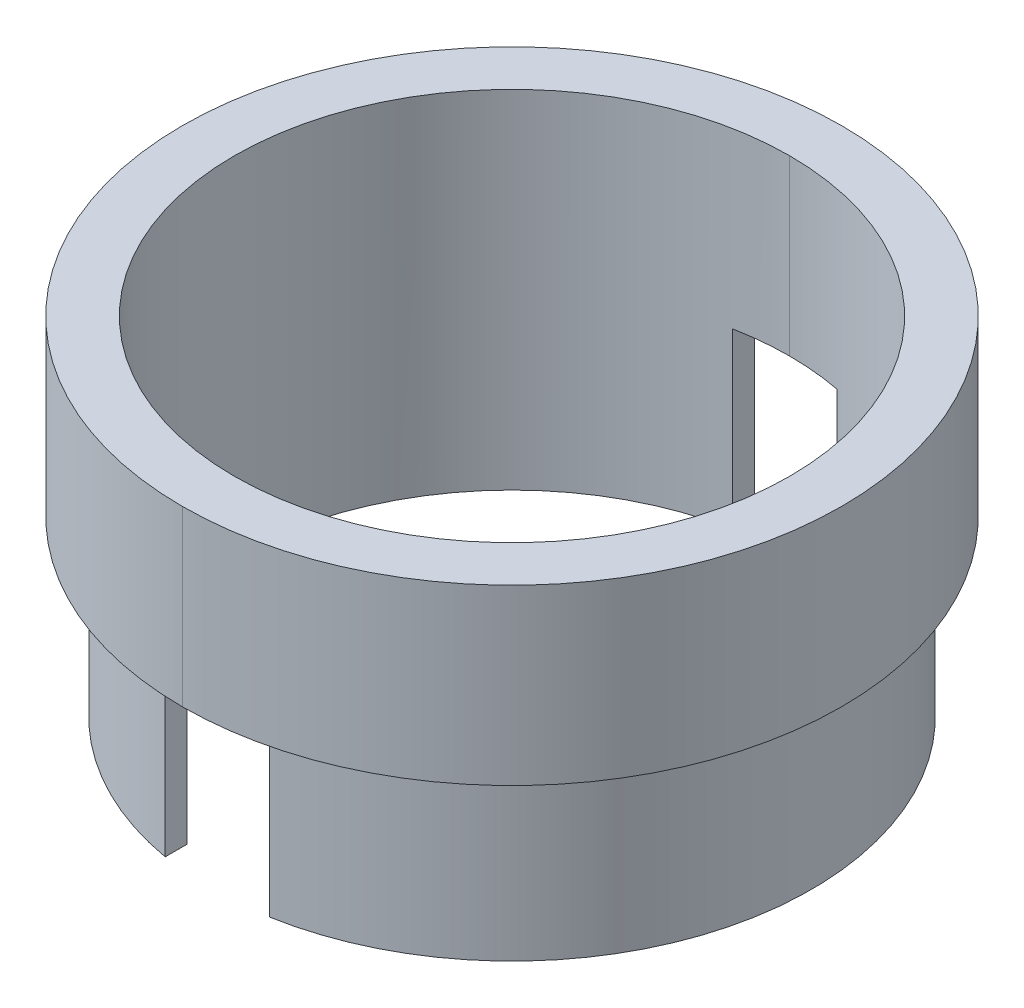
ISO-10303-21;
HEADER;
FILE_DESCRIPTION(('STEP AP214'),'2;1');
FILE_NAME('part.step','',(''),(''),'','','');
FILE_SCHEMA(('AUTOMOTIVE_DESIGN { 1 0 10303 214 1 1 1 1 }'));
ENDSEC;
DATA;
#1=APPLICATION_CONTEXT('core data for automotive mechanical design processes');
#2=APPLICATION_PROTOCOL_DEFINITION('international standard','automotive_design',2000,#1);
#3=PRODUCT_CONTEXT('',#1,'mechanical');
#4=PRODUCT('Part','Part','',(#3));
#5=PRODUCT_RELATED_PRODUCT_CATEGORY('part','',(#4));
#6=PRODUCT_DEFINITION_FORMATION('','',#4);
#7=PRODUCT_DEFINITION_CONTEXT('part definition',#1,'design');
#8=PRODUCT_DEFINITION('design','',#6,#7);
#9=PRODUCT_DEFINITION_SHAPE('','',#8);
#10=(LENGTH_UNIT() NAMED_UNIT(*) SI_UNIT(.MILLI.,.METRE.));
#11=(NAMED_UNIT(*) PLANE_ANGLE_UNIT() SI_UNIT($,.RADIAN.));
#12=(NAMED_UNIT(*) SI_UNIT($,.STERADIAN.) SOLID_ANGLE_UNIT());
#13=UNCERTAINTY_MEASURE_WITH_UNIT(LENGTH_MEASURE(1.E-05),#10,'distance_accuracy_value','');
#14=(GEOMETRIC_REPRESENTATION_CONTEXT(3) GLOBAL_UNCERTAINTY_ASSIGNED_CONTEXT((#13)) GLOBAL_UNIT_ASSIGNED_CONTEXT((#10,
#11,#12)) REPRESENTATION_CONTEXT('',''));
#15=CARTESIAN_POINT('',(0.,0.,0.));
#16=DIRECTION('',(0.,0.,1.));
#17=DIRECTION('',(1.,0.,0.));
#18=AXIS2_PLACEMENT_3D('',#15,#16,#17);
#19=CARTESIAN_POINT('',(0.,-5.,0.));
#20=DIRECTION('',(0.,-1.,0.));
#21=DIRECTION('',(0.,0.,-1.));
#22=AXIS2_PLACEMENT_3D('',#19,#20,#21);
#23=PLANE('',#22);
#24=DIRECTION('',(0.,0.,1.));
#25=VECTOR('',#24,1.);
#26=CARTESIAN_POINT('',(1.5,-5.,0.));
#27=LINE('',#26,#25);
#28=CARTESIAN_POINT('',(1.5,-5.,-8.49356373967959));
#29=VERTEX_POINT('',#28);
#30=CARTESIAN_POINT('',(1.5,-5.,-7.85811682275086));
#31=VERTEX_POINT('',#30);
#32=EDGE_CURVE('E98',#29,#31,#27,.T.);
#33=ORIENTED_EDGE('',*,*,#32,.F.);
#34=CARTESIAN_POINT('',(0.,-5.,0.));
#35=DIRECTION('',(0.,-1.,0.));
#36=DIRECTION('',(0.,0.,-1.));
#37=AXIS2_PLACEMENT_3D('',#34,#35,#36);
#38=CIRCLE('',#37,8.625);
#39=CARTESIAN_POINT('',(1.5,-5.,8.49356373967959));
#40=VERTEX_POINT('',#39);
#41=EDGE_CURVE('E26',#29,#40,#38,.T.);
#42=ORIENTED_EDGE('',*,*,#41,.T.);
#43=DIRECTION('',(0.,0.,1.));
#44=VECTOR('',#43,1.);
#45=CARTESIAN_POINT('',(1.5,-5.,0.));
#46=LINE('',#45,#44);
#47=CARTESIAN_POINT('',(1.5,-5.,7.85811682275086));
#48=VERTEX_POINT('',#47);
#49=EDGE_CURVE('E10',#48,#40,#46,.T.);
#50=ORIENTED_EDGE('',*,*,#49,.F.);
#51=CARTESIAN_POINT('',(0.,-5.,0.));
#52=DIRECTION('',(0.,1.,0.));
#53=DIRECTION('',(0.,0.,-1.));
#54=AXIS2_PLACEMENT_3D('',#51,#52,#53);
#55=CIRCLE('',#54,8.);
#56=EDGE_CURVE('E197',#48,#31,#55,.T.);
#57=ORIENTED_EDGE('',*,*,#56,.T.);
#58=EDGE_LOOP('',(#33,#42,#50,#57));
#59=FACE_BOUND('',#58,.T.);
#60=ADVANCED_FACE('F16',(#59),#23,.T.);
#61=CARTESIAN_POINT('',(1.5,-5.,0.));
#62=DIRECTION('',(-1.,0.,0.));
#63=DIRECTION('',(0.,0.,1.));
#64=AXIS2_PLACEMENT_3D('',#61,#62,#63);
#65=PLANE('',#64);
#66=DIRECTION('',(0.,0.,1.));
#67=VECTOR('',#66,1.);
#68=CARTESIAN_POINT('',(1.5,0.,0.));
#69=LINE('',#68,#67);
#70=CARTESIAN_POINT('',(1.5,0.,7.85811682275086));
#71=VERTEX_POINT('',#70);
#72=CARTESIAN_POINT('',(1.5,0.,8.49356373967959));
#73=VERTEX_POINT('',#72);
#74=EDGE_CURVE('E246',#71,#73,#69,.T.);
#75=ORIENTED_EDGE('',*,*,#74,.F.);
#76=DIRECTION('',(0.,1.,0.));
#77=VECTOR('',#76,1.);
#78=CARTESIAN_POINT('',(1.5,-5.,7.85811682275086));
#79=LINE('',#78,#77);
#80=EDGE_CURVE('E194',#48,#71,#79,.T.);
#81=ORIENTED_EDGE('',*,*,#80,.F.);
#82=ORIENTED_EDGE('',*,*,#49,.T.);
#83=DIRECTION('',(0.,1.,0.));
#84=VECTOR('',#83,1.);
#85=CARTESIAN_POINT('',(1.5,-5.,8.49356373967959));
#86=LINE('',#85,#84);
#87=EDGE_CURVE('E183',#40,#73,#86,.T.);
#88=ORIENTED_EDGE('',*,*,#87,.T.);
#89=EDGE_LOOP('',(#75,#81,#82,#88));
#90=FACE_BOUND('',#89,.T.);
#91=ADVANCED_FACE('F297',(#90),#65,.T.);
#92=CARTESIAN_POINT('',(0.,-5.,0.));
#93=DIRECTION('',(0.,1.,0.));
#94=DIRECTION('',(0.,0.,1.));
#95=AXIS2_PLACEMENT_3D('',#92,#93,#94);
#96=CYLINDRICAL_SURFACE('',#95,8.625);
#97=CARTESIAN_POINT('',(0.,0.,0.));
#98=DIRECTION('',(0.,-1.,0.));
#99=DIRECTION('',(0.,0.,-1.));
#100=AXIS2_PLACEMENT_3D('',#97,#98,#99);
#101=CIRCLE('',#100,8.625);
#102=CARTESIAN_POINT('',(1.5,0.,-8.49356373967959));
#103=VERTEX_POINT('',#102);
#104=EDGE_CURVE('E214',#103,#73,#101,.T.);
#105=ORIENTED_EDGE('',*,*,#104,.T.);
#106=ORIENTED_EDGE('',*,*,#87,.F.);
#107=ORIENTED_EDGE('',*,*,#41,.F.);
#108=DIRECTION('',(0.,1.,0.));
#109=VECTOR('',#108,1.);
#110=CARTESIAN_POINT('',(1.5,-5.,-8.49356373967959));
#111=LINE('',#110,#109);
#112=EDGE_CURVE('E208',#29,#103,#111,.T.);
#113=ORIENTED_EDGE('',*,*,#112,.T.);
#114=EDGE_LOOP('',(#105,#106,#107,#113));
#115=FACE_BOUND('',#114,.T.);
#116=ADVANCED_FACE('F295',(#115),#96,.T.);
#117=CARTESIAN_POINT('',(1.5,-5.,0.));
#118=DIRECTION('',(-1.,0.,0.));
#119=DIRECTION('',(0.,0.,1.));
#120=AXIS2_PLACEMENT_3D('',#117,#118,#119);
#121=PLANE('',#120);
#122=DIRECTION('',(0.,0.,1.));
#123=VECTOR('',#122,1.);
#124=CARTESIAN_POINT('',(1.5,0.,0.));
#125=LINE('',#124,#123);
#126=CARTESIAN_POINT('',(1.5,0.,-7.85811682275086));
#127=VERTEX_POINT('',#126);
#128=EDGE_CURVE('E209',#103,#127,#125,.T.);
#129=ORIENTED_EDGE('',*,*,#128,.F.);
#130=ORIENTED_EDGE('',*,*,#112,.F.);
#131=ORIENTED_EDGE('',*,*,#32,.T.);
#132=DIRECTION('',(0.,1.,0.));
#133=VECTOR('',#132,1.);
#134=CARTESIAN_POINT('',(1.5,-5.,-7.85811682275086));
#135=LINE('',#134,#133);
#136=EDGE_CURVE('E239',#31,#127,#135,.T.);
#137=ORIENTED_EDGE('',*,*,#136,.T.);
#138=EDGE_LOOP('',(#129,#130,#131,#137));
#139=FACE_BOUND('',#138,.T.);
#140=ADVANCED_FACE('F291',(#139),#121,.T.);
#141=CARTESIAN_POINT('',(0.,-5.,0.));
#142=DIRECTION('',(0.,-1.,0.));
#143=DIRECTION('',(0.,0.,-1.));
#144=AXIS2_PLACEMENT_3D('',#141,#142,#143);
#145=PLANE('',#144);
#146=DIRECTION('',(0.,0.,-1.));
#147=VECTOR('',#146,1.);
#148=CARTESIAN_POINT('',(-1.5,-5.,0.));
#149=LINE('',#148,#147);
#150=CARTESIAN_POINT('',(-1.5,-5.,8.49356373967959));
#151=VERTEX_POINT('',#150);
#152=CARTESIAN_POINT('',(-1.5,-5.,7.85811682275086));
#153=VERTEX_POINT('',#152);
#154=EDGE_CURVE('E182',#151,#153,#149,.T.);
#155=ORIENTED_EDGE('',*,*,#154,.F.);
#156=CARTESIAN_POINT('',(0.,-5.,0.));
#157=DIRECTION('',(0.,-1.,0.));
#158=DIRECTION('',(0.,0.,-1.));
#159=AXIS2_PLACEMENT_3D('',#156,#157,#158);
#160=CIRCLE('',#159,8.625);
#161=CARTESIAN_POINT('',(-1.5,-5.,-8.49356373967959));
#162=VERTEX_POINT('',#161);
#163=EDGE_CURVE('E181',#151,#162,#160,.T.);
#164=ORIENTED_EDGE('',*,*,#163,.T.);
#165=DIRECTION('',(0.,0.,-1.));
#166=VECTOR('',#165,1.);
#167=CARTESIAN_POINT('',(-1.5,-5.,0.));
#168=LINE('',#167,#166);
#169=CARTESIAN_POINT('',(-1.5,-5.,-7.85811682275086));
#170=VERTEX_POINT('',#169);
#171=EDGE_CURVE('E204',#170,#162,#168,.T.);
#172=ORIENTED_EDGE('',*,*,#171,.F.);
#173=CARTESIAN_POINT('',(0.,-5.,0.));
#174=DIRECTION('',(0.,1.,0.));
#175=DIRECTION('',(0.,0.,-1.));
#176=AXIS2_PLACEMENT_3D('',#173,#174,#175);
#177=CIRCLE('',#176,8.);
#178=EDGE_CURVE('E172',#170,#153,#177,.T.);
#179=ORIENTED_EDGE('',*,*,#178,.T.);
#180=EDGE_LOOP('',(#155,#164,#172,#179));
#181=FACE_BOUND('',#180,.T.);
#182=ADVANCED_FACE('F283',(#181),#145,.T.);
#183=CARTESIAN_POINT('',(-1.5,-5.,0.));
#184=DIRECTION('',(1.,0.,0.));
#185=DIRECTION('',(0.,1.,0.));
#186=AXIS2_PLACEMENT_3D('',#183,#184,#185);
#187=PLANE('',#186);
#188=DIRECTION('',(0.,0.,-1.));
#189=VECTOR('',#188,1.);
#190=CARTESIAN_POINT('',(-1.5,0.,0.));
#191=LINE('',#190,#189);
#192=CARTESIAN_POINT('',(-1.5,0.,-7.85811682275086));
#193=VERTEX_POINT('',#192);
#194=CARTESIAN_POINT('',(-1.5,0.,-8.49356373967959));
#195=VERTEX_POINT('',#194);
#196=EDGE_CURVE('E203',#193,#195,#191,.T.);
#197=ORIENTED_EDGE('',*,*,#196,.F.);
#198=DIRECTION('',(0.,1.,0.));
#199=VECTOR('',#198,1.);
#200=CARTESIAN_POINT('',(-1.5,-5.,-7.85811682275086));
#201=LINE('',#200,#199);
#202=EDGE_CURVE('E176',#170,#193,#201,.T.);
#203=ORIENTED_EDGE('',*,*,#202,.F.);
#204=ORIENTED_EDGE('',*,*,#171,.T.);
#205=DIRECTION('',(0.,1.,0.));
#206=VECTOR('',#205,1.);
#207=CARTESIAN_POINT('',(-1.5,-5.,-8.49356373967959));
#208=LINE('',#207,#206);
#209=EDGE_CURVE('E178',#162,#195,#208,.T.);
#210=ORIENTED_EDGE('',*,*,#209,.T.);
#211=EDGE_LOOP('',(#197,#203,#204,#210));
#212=FACE_BOUND('',#211,.T.);
#213=ADVANCED_FACE('F287',(#212),#187,.T.);
#214=CARTESIAN_POINT('',(0.,-5.,0.));
#215=DIRECTION('',(0.,1.,0.));
#216=DIRECTION('',(0.,0.,1.));
#217=AXIS2_PLACEMENT_3D('',#214,#215,#216);
#218=CYLINDRICAL_SURFACE('',#217,8.625);
#219=CARTESIAN_POINT('',(0.,0.,0.));
#220=DIRECTION('',(0.,-1.,0.));
#221=DIRECTION('',(0.,0.,-1.));
#222=AXIS2_PLACEMENT_3D('',#219,#220,#221);
#223=CIRCLE('',#222,8.625);
#224=CARTESIAN_POINT('',(-1.5,0.,8.49356373967959));
#225=VERTEX_POINT('',#224);
#226=EDGE_CURVE('E198',#225,#195,#223,.T.);
#227=ORIENTED_EDGE('',*,*,#226,.T.);
#228=ORIENTED_EDGE('',*,*,#209,.F.);
#229=ORIENTED_EDGE('',*,*,#163,.F.);
#230=DIRECTION('',(0.,1.,0.));
#231=VECTOR('',#230,1.);
#232=CARTESIAN_POINT('',(-1.5,-5.,8.49356373967959));
#233=LINE('',#232,#231);
#234=EDGE_CURVE('E193',#151,#225,#233,.T.);
#235=ORIENTED_EDGE('',*,*,#234,.T.);
#236=EDGE_LOOP('',(#227,#228,#229,#235));
#237=FACE_BOUND('',#236,.T.);
#238=ADVANCED_FACE('F319',(#237),#218,.T.);
#239=CARTESIAN_POINT('',(-1.5,-5.,0.));
#240=DIRECTION('',(1.,0.,0.));
#241=DIRECTION('',(0.,1.,0.));
#242=AXIS2_PLACEMENT_3D('',#239,#240,#241);
#243=PLANE('',#242);
#244=DIRECTION('',(0.,0.,-1.));
#245=VECTOR('',#244,1.);
#246=CARTESIAN_POINT('',(-1.5,0.,0.));
#247=LINE('',#246,#245);
#248=CARTESIAN_POINT('',(-1.5,0.,7.85811682275086));
#249=VERTEX_POINT('',#248);
#250=EDGE_CURVE('E202',#225,#249,#247,.T.);
#251=ORIENTED_EDGE('',*,*,#250,.F.);
#252=ORIENTED_EDGE('',*,*,#234,.F.);
#253=ORIENTED_EDGE('',*,*,#154,.T.);
#254=DIRECTION('',(0.,1.,0.));
#255=VECTOR('',#254,1.);
#256=CARTESIAN_POINT('',(-1.5,-5.,7.85811682275086));
#257=LINE('',#256,#255);
#258=EDGE_CURVE('E177',#153,#249,#257,.T.);
#259=ORIENTED_EDGE('',*,*,#258,.T.);
#260=EDGE_LOOP('',(#251,#252,#253,#259));
#261=FACE_BOUND('',#260,.T.);
#262=ADVANCED_FACE('F279',(#261),#243,.T.);
#263=CARTESIAN_POINT('',(0.,5.,0.));
#264=DIRECTION('',(0.,-1.,0.));
#265=DIRECTION('',(0.,0.,-1.));
#266=AXIS2_PLACEMENT_3D('',#263,#264,#265);
#267=CYLINDRICAL_SURFACE('',#266,8.);
#268=DIRECTION('',(0.,-1.,0.));
#269=VECTOR('',#268,1.);
#270=CARTESIAN_POINT('',(0.,5.,8.));
#271=LINE('',#270,#269);
#272=CARTESIAN_POINT('',(0.,5.,8.));
#273=VERTEX_POINT('',#272);
#274=CARTESIAN_POINT('',(0.,0.,8.));
#275=VERTEX_POINT('',#274);
#276=EDGE_CURVE('E146',#273,#275,#271,.T.);
#277=ORIENTED_EDGE('',*,*,#276,.F.);
#278=CARTESIAN_POINT('',(0.,5.,0.));
#279=DIRECTION('',(0.,1.,0.));
#280=DIRECTION('',(0.,0.,1.));
#281=AXIS2_PLACEMENT_3D('',#278,#279,#280);
#282=CIRCLE('',#281,8.);
#283=CARTESIAN_POINT('',(0.,5.,-8.));
#284=VERTEX_POINT('',#283);
#285=EDGE_CURVE('E138',#273,#284,#282,.T.);
#286=ORIENTED_EDGE('',*,*,#285,.T.);
#287=DIRECTION('',(0.,-1.,0.));
#288=VECTOR('',#287,1.);
#289=CARTESIAN_POINT('',(0.,5.,-8.));
#290=LINE('',#289,#288);
#291=CARTESIAN_POINT('',(0.,0.,-8.));
#292=VERTEX_POINT('',#291);
#293=EDGE_CURVE('E142',#284,#292,#290,.T.);
#294=ORIENTED_EDGE('',*,*,#293,.T.);
#295=CARTESIAN_POINT('',(0.,0.,0.));
#296=DIRECTION('',(0.,1.,0.));
#297=DIRECTION('',(0.,0.,1.));
#298=AXIS2_PLACEMENT_3D('',#295,#296,#297);
#299=CIRCLE('',#298,8.);
#300=EDGE_CURVE('E213',#127,#292,#299,.T.);
#301=ORIENTED_EDGE('',*,*,#300,.F.);
#302=ORIENTED_EDGE('',*,*,#136,.F.);
#303=ORIENTED_EDGE('',*,*,#56,.F.);
#304=ORIENTED_EDGE('',*,*,#80,.T.);
#305=CARTESIAN_POINT('',(0.,0.,0.));
#306=DIRECTION('',(0.,1.,0.));
#307=DIRECTION('',(0.,0.,1.));
#308=AXIS2_PLACEMENT_3D('',#305,#306,#307);
#309=CIRCLE('',#308,8.);
#310=EDGE_CURVE('E242',#275,#71,#309,.T.);
#311=ORIENTED_EDGE('',*,*,#310,.F.);
#312=EDGE_LOOP('',(#277,#286,#294,#301,#302,#303,#304,#311));
#313=FACE_BOUND('',#312,.T.);
#314=ADVANCED_FACE('F140',(#313),#267,.F.);
#315=CARTESIAN_POINT('',(0.,5.,0.));
#316=DIRECTION('',(0.,-1.,0.));
#317=DIRECTION('',(0.,0.,-1.));
#318=AXIS2_PLACEMENT_3D('',#315,#316,#317);
#319=CYLINDRICAL_SURFACE('',#318,9.5);
#320=DIRECTION('',(0.,-1.,0.));
#321=VECTOR('',#320,1.);
#322=CARTESIAN_POINT('',(0.,5.,9.5));
#323=LINE('',#322,#321);
#324=CARTESIAN_POINT('',(0.,5.,9.5));
#325=VERTEX_POINT('',#324);
#326=CARTESIAN_POINT('',(0.,0.,9.5));
#327=VERTEX_POINT('',#326);
#328=EDGE_CURVE('E19',#325,#327,#323,.T.);
#329=ORIENTED_EDGE('',*,*,#328,.F.);
#330=CARTESIAN_POINT('',(0.,5.,0.));
#331=DIRECTION('',(0.,1.,0.));
#332=DIRECTION('',(0.,0.,1.));
#333=AXIS2_PLACEMENT_3D('',#330,#331,#332);
#334=CIRCLE('',#333,9.5);
#335=CARTESIAN_POINT('',(0.,5.,-9.5));
#336=VERTEX_POINT('',#335);
#337=EDGE_CURVE('E152',#336,#325,#334,.T.);
#338=ORIENTED_EDGE('',*,*,#337,.F.);
#339=DIRECTION('',(0.,-1.,0.));
#340=VECTOR('',#339,1.);
#341=CARTESIAN_POINT('',(0.,5.,-9.5));
#342=LINE('',#341,#340);
#343=CARTESIAN_POINT('',(0.,0.,-9.5));
#344=VERTEX_POINT('',#343);
#345=EDGE_CURVE('E186',#336,#344,#342,.T.);
#346=ORIENTED_EDGE('',*,*,#345,.T.);
#347=CARTESIAN_POINT('',(0.,0.,0.));
#348=DIRECTION('',(0.,1.,0.));
#349=DIRECTION('',(0.,0.,1.));
#350=AXIS2_PLACEMENT_3D('',#347,#348,#349);
#351=CIRCLE('',#350,9.5);
#352=EDGE_CURVE('E151',#344,#327,#351,.T.);
#353=ORIENTED_EDGE('',*,*,#352,.T.);
#354=EDGE_LOOP('',(#329,#338,#346,#353));
#355=FACE_BOUND('',#354,.T.);
#356=ADVANCED_FACE('F310',(#355),#319,.T.);
#357=CARTESIAN_POINT('',(0.,0.,0.));
#358=DIRECTION('',(0.,1.,0.));
#359=DIRECTION('',(1.,0.,0.));
#360=AXIS2_PLACEMENT_3D('',#357,#358,#359);
#361=PLANE('',#360);
#362=ORIENTED_EDGE('',*,*,#104,.F.);
#363=ORIENTED_EDGE('',*,*,#128,.T.);
#364=ORIENTED_EDGE('',*,*,#300,.T.);
#365=CARTESIAN_POINT('',(0.,0.,0.));
#366=DIRECTION('',(0.,1.,0.));
#367=DIRECTION('',(0.,0.,1.));
#368=AXIS2_PLACEMENT_3D('',#365,#366,#367);
#369=CIRCLE('',#368,8.);
#370=EDGE_CURVE('E158',#292,#193,#369,.T.);
#371=ORIENTED_EDGE('',*,*,#370,.T.);
#372=ORIENTED_EDGE('',*,*,#196,.T.);
#373=ORIENTED_EDGE('',*,*,#226,.F.);
#374=ORIENTED_EDGE('',*,*,#250,.T.);
#375=CARTESIAN_POINT('',(0.,0.,0.));
#376=DIRECTION('',(0.,1.,0.));
#377=DIRECTION('',(0.,0.,1.));
#378=AXIS2_PLACEMENT_3D('',#375,#376,#377);
#379=CIRCLE('',#378,8.);
#380=EDGE_CURVE('E169',#249,#275,#379,.T.);
#381=ORIENTED_EDGE('',*,*,#380,.T.);
#382=ORIENTED_EDGE('',*,*,#310,.T.);
#383=ORIENTED_EDGE('',*,*,#74,.T.);
#384=EDGE_LOOP('',(#362,#363,#364,#371,#372,#373,#374,#381,#382,#383));
#385=FACE_BOUND('',#384,.T.);
#386=ORIENTED_EDGE('',*,*,#352,.F.);
#387=CARTESIAN_POINT('',(0.,0.,0.));
#388=DIRECTION('',(0.,1.,0.));
#389=DIRECTION('',(0.,0.,1.));
#390=AXIS2_PLACEMENT_3D('',#387,#388,#389);
#391=CIRCLE('',#390,9.5);
#392=EDGE_CURVE('E189',#327,#344,#391,.T.);
#393=ORIENTED_EDGE('',*,*,#392,.F.);
#394=EDGE_LOOP('',(#386,#393));
#395=FACE_BOUND('',#394,.T.);
#396=ADVANCED_FACE('F272',(#385,#395),#361,.F.);
#397=CARTESIAN_POINT('',(0.,5.,0.));
#398=DIRECTION('',(0.,1.,0.));
#399=DIRECTION('',(1.,0.,0.));
#400=AXIS2_PLACEMENT_3D('',#397,#398,#399);
#401=PLANE('',#400);
#402=CARTESIAN_POINT('',(0.,5.,0.));
#403=DIRECTION('',(0.,1.,0.));
#404=DIRECTION('',(0.,0.,1.));
#405=AXIS2_PLACEMENT_3D('',#402,#403,#404);
#406=CIRCLE('',#405,8.);
#407=EDGE_CURVE('E155',#284,#273,#406,.T.);
#408=ORIENTED_EDGE('',*,*,#407,.F.);
#409=ORIENTED_EDGE('',*,*,#285,.F.);
#410=EDGE_LOOP('',(#408,#409));
#411=FACE_BOUND('',#410,.T.);
#412=ORIENTED_EDGE('',*,*,#337,.T.);
#413=CARTESIAN_POINT('',(0.,5.,0.));
#414=DIRECTION('',(0.,1.,0.));
#415=DIRECTION('',(0.,0.,1.));
#416=AXIS2_PLACEMENT_3D('',#413,#414,#415);
#417=CIRCLE('',#416,9.5);
#418=EDGE_CURVE('E160',#325,#336,#417,.T.);
#419=ORIENTED_EDGE('',*,*,#418,.T.);
#420=EDGE_LOOP('',(#412,#419));
#421=FACE_BOUND('',#420,.T.);
#422=ADVANCED_FACE('F162',(#411,#421),#401,.T.);
#423=CARTESIAN_POINT('',(0.,5.,0.));
#424=DIRECTION('',(0.,-1.,0.));
#425=DIRECTION('',(0.,0.,-1.));
#426=AXIS2_PLACEMENT_3D('',#423,#424,#425);
#427=CYLINDRICAL_SURFACE('',#426,9.5);
#428=ORIENTED_EDGE('',*,*,#418,.F.);
#429=ORIENTED_EDGE('',*,*,#328,.T.);
#430=ORIENTED_EDGE('',*,*,#392,.T.);
#431=ORIENTED_EDGE('',*,*,#345,.F.);
#432=EDGE_LOOP('',(#428,#429,#430,#431));
#433=FACE_BOUND('',#432,.T.);
#434=ADVANCED_FACE('F316',(#433),#427,.T.);
#435=CARTESIAN_POINT('',(0.,5.,0.));
#436=DIRECTION('',(0.,-1.,0.));
#437=DIRECTION('',(0.,0.,-1.));
#438=AXIS2_PLACEMENT_3D('',#435,#436,#437);
#439=CYLINDRICAL_SURFACE('',#438,8.);
#440=ORIENTED_EDGE('',*,*,#407,.T.);
#441=ORIENTED_EDGE('',*,*,#276,.T.);
#442=ORIENTED_EDGE('',*,*,#380,.F.);
#443=ORIENTED_EDGE('',*,*,#258,.F.);
#444=ORIENTED_EDGE('',*,*,#178,.F.);
#445=ORIENTED_EDGE('',*,*,#202,.T.);
#446=ORIENTED_EDGE('',*,*,#370,.F.);
#447=ORIENTED_EDGE('',*,*,#293,.F.);
#448=EDGE_LOOP('',(#440,#441,#442,#443,#444,#445,#446,#447));
#449=FACE_BOUND('',#448,.T.);
#450=ADVANCED_FACE('F154',(#449),#439,.F.);
#451=CLOSED_SHELL('',(#60,#91,#116,#140,#182,#213,#238,#262,#314,#356,#396,#422,#434,#450));
#452=MANIFOLD_SOLID_BREP('B1',#451);
#453=ADVANCED_BREP_SHAPE_REPRESENTATION('',(#18,#452),#14);
#454=SHAPE_DEFINITION_REPRESENTATION(#9,#453);
ENDSEC;
END-ISO-10303-21;
